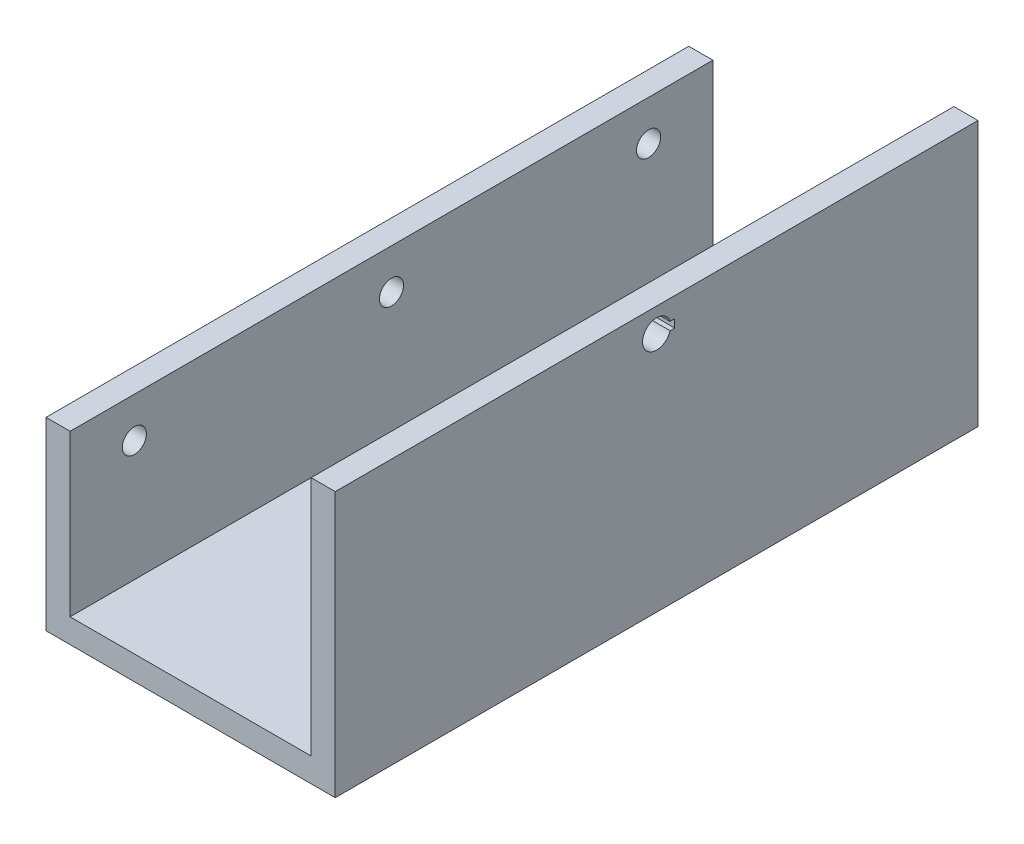
ISO-10303-21;
HEADER;
FILE_DESCRIPTION(('STEP AP214'),'2;1');
FILE_NAME('part.step','',(''),(''),'','','');
FILE_SCHEMA(('AUTOMOTIVE_DESIGN { 1 0 10303 214 1 1 1 1 }'));
ENDSEC;
DATA;
#1=APPLICATION_CONTEXT('core data for automotive mechanical design processes');
#2=APPLICATION_PROTOCOL_DEFINITION('international standard','automotive_design',2000,#1);
#3=PRODUCT_CONTEXT('',#1,'mechanical');
#4=PRODUCT('Part','Part','',(#3));
#5=PRODUCT_RELATED_PRODUCT_CATEGORY('part','',(#4));
#6=PRODUCT_DEFINITION_FORMATION('','',#4);
#7=PRODUCT_DEFINITION_CONTEXT('part definition',#1,'design');
#8=PRODUCT_DEFINITION('design','',#6,#7);
#9=PRODUCT_DEFINITION_SHAPE('','',#8);
#10=(LENGTH_UNIT() NAMED_UNIT(*) SI_UNIT(.MILLI.,.METRE.));
#11=(NAMED_UNIT(*) PLANE_ANGLE_UNIT() SI_UNIT($,.RADIAN.));
#12=(NAMED_UNIT(*) SI_UNIT($,.STERADIAN.) SOLID_ANGLE_UNIT());
#13=UNCERTAINTY_MEASURE_WITH_UNIT(LENGTH_MEASURE(1.E-05),#10,'distance_accuracy_value','');
#14=(GEOMETRIC_REPRESENTATION_CONTEXT(3) GLOBAL_UNCERTAINTY_ASSIGNED_CONTEXT((#13)) GLOBAL_UNIT_ASSIGNED_CONTEXT((#10,
#11,#12)) REPRESENTATION_CONTEXT('',''));
#15=CARTESIAN_POINT('',(0.,0.,0.));
#16=DIRECTION('',(0.,0.,1.));
#17=DIRECTION('',(1.,0.,0.));
#18=AXIS2_PLACEMENT_3D('',#15,#16,#17);
#19=CARTESIAN_POINT('',(0.,0.,0.));
#20=DIRECTION('',(0.,0.,1.));
#21=DIRECTION('',(1.,0.,0.));
#22=AXIS2_PLACEMENT_3D('',#19,#20,#21);
#23=PLANE('',#22);
#24=DIRECTION('',(0.,-1.,0.));
#25=VECTOR('',#24,1.);
#26=CARTESIAN_POINT('',(-33.,2.99999999999999,0.));
#27=LINE('',#26,#25);
#28=CARTESIAN_POINT('',(-33.,-7.00000000000001,0.));
#29=VERTEX_POINT('',#28);
#30=CARTESIAN_POINT('',(-33.,-30.,0.));
#31=VERTEX_POINT('',#30);
#32=EDGE_CURVE('E147',#29,#31,#27,.T.);
#33=ORIENTED_EDGE('',*,*,#32,.F.);
#34=DIRECTION('',(-1.,0.,0.));
#35=VECTOR('',#34,1.);
#36=CARTESIAN_POINT('',(3.00100000000002,-7.,0.));
#37=LINE('',#36,#35);
#38=CARTESIAN_POINT('',(-30.,-7.00000000000001,0.));
#39=VERTEX_POINT('',#38);
#40=EDGE_CURVE('E59',#39,#29,#37,.T.);
#41=ORIENTED_EDGE('',*,*,#40,.F.);
#42=DIRECTION('',(0.,-1.,0.));
#43=VECTOR('',#42,1.);
#44=CARTESIAN_POINT('',(-30.,2.99999999999999,0.));
#45=LINE('',#44,#43);
#46=CARTESIAN_POINT('',(-30.,-27.,0.));
#47=VERTEX_POINT('',#46);
#48=EDGE_CURVE('E144',#39,#47,#45,.T.);
#49=ORIENTED_EDGE('',*,*,#48,.T.);
#50=DIRECTION('',(-1.,0.,0.));
#51=VECTOR('',#50,1.);
#52=CARTESIAN_POINT('',(0.,-27.,0.));
#53=LINE('',#52,#51);
#54=CARTESIAN_POINT('',(0.,-27.,0.));
#55=VERTEX_POINT('',#54);
#56=EDGE_CURVE('E183',#55,#47,#53,.T.);
#57=ORIENTED_EDGE('',*,*,#56,.F.);
#58=DIRECTION('',(0.,-1.,0.));
#59=VECTOR('',#58,1.);
#60=CARTESIAN_POINT('',(0.,3.,0.));
#61=LINE('',#60,#59);
#62=CARTESIAN_POINT('',(0.,3.,0.));
#63=VERTEX_POINT('',#62);
#64=EDGE_CURVE('E178',#63,#55,#61,.T.);
#65=ORIENTED_EDGE('',*,*,#64,.F.);
#66=DIRECTION('',(1.,0.,0.));
#67=VECTOR('',#66,1.);
#68=CARTESIAN_POINT('',(0.,3.,0.));
#69=LINE('',#68,#67);
#70=CARTESIAN_POINT('',(3.,3.,0.));
#71=VERTEX_POINT('',#70);
#72=EDGE_CURVE('E170',#63,#71,#69,.T.);
#73=ORIENTED_EDGE('',*,*,#72,.T.);
#74=DIRECTION('',(0.,-1.,0.));
#75=VECTOR('',#74,1.);
#76=CARTESIAN_POINT('',(3.,3.,0.));
#77=LINE('',#76,#75);
#78=CARTESIAN_POINT('',(3.00000000000001,-30.,0.));
#79=VERTEX_POINT('',#78);
#80=EDGE_CURVE('E187',#71,#79,#77,.T.);
#81=ORIENTED_EDGE('',*,*,#80,.T.);
#82=DIRECTION('',(1.,0.,0.));
#83=VECTOR('',#82,1.);
#84=CARTESIAN_POINT('',(-30.,-30.,0.));
#85=LINE('',#84,#83);
#86=EDGE_CURVE('E207',#31,#79,#85,.T.);
#87=ORIENTED_EDGE('',*,*,#86,.F.);
#88=EDGE_LOOP('',(#33,#41,#49,#57,#65,#73,#81,#87));
#89=FACE_BOUND('',#88,.T.);
#90=ADVANCED_FACE('F42',(#89),#23,.F.);
#91=CARTESIAN_POINT('',(-30.,-30.,2.));
#92=DIRECTION('',(0.,1.,0.));
#93=DIRECTION('',(-1.,0.,0.));
#94=AXIS2_PLACEMENT_3D('',#91,#92,#93);
#95=PLANE('',#94);
#96=CARTESIAN_POINT('',(-15.,-30.,19.53));
#97=DIRECTION('',(0.,-1.,0.));
#98=DIRECTION('',(1.,0.,0.));
#99=AXIS2_PLACEMENT_3D('',#96,#97,#98);
#100=CIRCLE('',#99,4.);
#101=CARTESIAN_POINT('',(-11.,-30.,19.53));
#102=VERTEX_POINT('',#101);
#103=EDGE_CURVE('E194',#102,#102,#100,.T.);
#104=ORIENTED_EDGE('',*,*,#103,.F.);
#105=EDGE_LOOP('',(#104));
#106=FACE_BOUND('',#105,.T.);
#107=ORIENTED_EDGE('',*,*,#86,.T.);
#108=DIRECTION('',(0.,0.,1.));
#109=VECTOR('',#108,1.);
#110=CARTESIAN_POINT('',(3.,-30.,80.));
#111=LINE('',#110,#109);
#112=CARTESIAN_POINT('',(3.,-30.,80.));
#113=VERTEX_POINT('',#112);
#114=EDGE_CURVE('E154',#79,#113,#111,.T.);
#115=ORIENTED_EDGE('',*,*,#114,.T.);
#116=DIRECTION('',(1.,0.,0.));
#117=VECTOR('',#116,1.);
#118=CARTESIAN_POINT('',(-30.,-30.,80.));
#119=LINE('',#118,#117);
#120=CARTESIAN_POINT('',(-33.,-30.,80.));
#121=VERTEX_POINT('',#120);
#122=EDGE_CURVE('E199',#121,#113,#119,.T.);
#123=ORIENTED_EDGE('',*,*,#122,.F.);
#124=DIRECTION('',(0.,0.,-1.));
#125=VECTOR('',#124,1.);
#126=CARTESIAN_POINT('',(-33.,-30.,80.));
#127=LINE('',#126,#125);
#128=EDGE_CURVE('E162',#121,#31,#127,.T.);
#129=ORIENTED_EDGE('',*,*,#128,.T.);
#130=EDGE_LOOP('',(#107,#115,#123,#129));
#131=FACE_BOUND('',#130,.T.);
#132=ADVANCED_FACE('F44',(#106,#131),#95,.F.);
#133=CARTESIAN_POINT('',(-30.,-27.,78.));
#134=DIRECTION('',(0.,-1.,0.));
#135=DIRECTION('',(0.,0.,-1.));
#136=AXIS2_PLACEMENT_3D('',#133,#134,#135);
#137=PLANE('',#136);
#138=CARTESIAN_POINT('',(-15.,-27.,19.53));
#139=DIRECTION('',(0.,-1.,0.));
#140=DIRECTION('',(1.,0.,0.));
#141=AXIS2_PLACEMENT_3D('',#138,#139,#140);
#142=CIRCLE('',#141,4.);
#143=CARTESIAN_POINT('',(-11.,-27.,19.53));
#144=VERTEX_POINT('',#143);
#145=EDGE_CURVE('E196',#144,#144,#142,.T.);
#146=ORIENTED_EDGE('',*,*,#145,.T.);
#147=EDGE_LOOP('',(#146));
#148=FACE_BOUND('',#147,.T.);
#149=DIRECTION('',(0.,0.,-1.));
#150=VECTOR('',#149,1.);
#151=CARTESIAN_POINT('',(0.,-27.,78.));
#152=LINE('',#151,#150);
#153=CARTESIAN_POINT('',(0.,-27.,80.));
#154=VERTEX_POINT('',#153);
#155=EDGE_CURVE('E204',#154,#55,#152,.T.);
#156=ORIENTED_EDGE('',*,*,#155,.T.);
#157=ORIENTED_EDGE('',*,*,#56,.T.);
#158=DIRECTION('',(0.,0.,-1.));
#159=VECTOR('',#158,1.);
#160=CARTESIAN_POINT('',(-30.,-27.,78.));
#161=LINE('',#160,#159);
#162=CARTESIAN_POINT('',(-30.,-27.,80.));
#163=VERTEX_POINT('',#162);
#164=EDGE_CURVE('E153',#163,#47,#161,.T.);
#165=ORIENTED_EDGE('',*,*,#164,.F.);
#166=DIRECTION('',(1.,0.,0.));
#167=VECTOR('',#166,1.);
#168=CARTESIAN_POINT('',(-30.,-27.,80.));
#169=LINE('',#168,#167);
#170=EDGE_CURVE('E191',#163,#154,#169,.T.);
#171=ORIENTED_EDGE('',*,*,#170,.T.);
#172=EDGE_LOOP('',(#156,#157,#165,#171));
#173=FACE_BOUND('',#172,.T.);
#174=ADVANCED_FACE('F265',(#148,#173),#137,.F.);
#175=CARTESIAN_POINT('',(0.,0.,80.));
#176=DIRECTION('',(0.,0.,-1.));
#177=DIRECTION('',(1.,0.,0.));
#178=AXIS2_PLACEMENT_3D('',#175,#176,#177);
#179=PLANE('',#178);
#180=DIRECTION('',(0.,-1.,0.));
#181=VECTOR('',#180,1.);
#182=CARTESIAN_POINT('',(-30.,2.99999999999999,80.));
#183=LINE('',#182,#181);
#184=CARTESIAN_POINT('',(-30.,-7.00000000000001,80.));
#185=VERTEX_POINT('',#184);
#186=EDGE_CURVE('E166',#185,#163,#183,.T.);
#187=ORIENTED_EDGE('',*,*,#186,.F.);
#188=DIRECTION('',(-1.,0.,0.));
#189=VECTOR('',#188,1.);
#190=CARTESIAN_POINT('',(3.00100000000002,-7.,80.));
#191=LINE('',#190,#189);
#192=CARTESIAN_POINT('',(-33.,-7.00000000000001,80.));
#193=VERTEX_POINT('',#192);
#194=EDGE_CURVE('E135',#185,#193,#191,.T.);
#195=ORIENTED_EDGE('',*,*,#194,.T.);
#196=DIRECTION('',(0.,-1.,0.));
#197=VECTOR('',#196,1.);
#198=CARTESIAN_POINT('',(-33.,2.99999999999999,80.));
#199=LINE('',#198,#197);
#200=EDGE_CURVE('E159',#193,#121,#199,.T.);
#201=ORIENTED_EDGE('',*,*,#200,.T.);
#202=ORIENTED_EDGE('',*,*,#122,.T.);
#203=DIRECTION('',(0.,-1.,0.));
#204=VECTOR('',#203,1.);
#205=CARTESIAN_POINT('',(2.99999999999999,3.,80.));
#206=LINE('',#205,#204);
#207=CARTESIAN_POINT('',(2.99999999999999,3.,80.));
#208=VERTEX_POINT('',#207);
#209=EDGE_CURVE('E184',#208,#113,#206,.T.);
#210=ORIENTED_EDGE('',*,*,#209,.F.);
#211=DIRECTION('',(-1.,0.,0.));
#212=VECTOR('',#211,1.);
#213=CARTESIAN_POINT('',(0.,3.,80.));
#214=LINE('',#213,#212);
#215=CARTESIAN_POINT('',(0.,3.,80.));
#216=VERTEX_POINT('',#215);
#217=EDGE_CURVE('E176',#208,#216,#214,.T.);
#218=ORIENTED_EDGE('',*,*,#217,.T.);
#219=DIRECTION('',(0.,-1.,0.));
#220=VECTOR('',#219,1.);
#221=CARTESIAN_POINT('',(0.,3.,80.));
#222=LINE('',#221,#220);
#223=EDGE_CURVE('E180',#216,#154,#222,.T.);
#224=ORIENTED_EDGE('',*,*,#223,.T.);
#225=ORIENTED_EDGE('',*,*,#170,.F.);
#226=EDGE_LOOP('',(#187,#195,#201,#202,#210,#218,#224,#225));
#227=FACE_BOUND('',#226,.T.);
#228=ADVANCED_FACE('F262',(#227),#179,.F.);
#229=CARTESIAN_POINT('',(-15.,-27.,19.53));
#230=DIRECTION('',(0.,-1.,0.));
#231=DIRECTION('',(1.,0.,0.));
#232=AXIS2_PLACEMENT_3D('',#229,#230,#231);
#233=CYLINDRICAL_SURFACE('',#232,4.);
#234=ORIENTED_EDGE('',*,*,#145,.F.);
#235=EDGE_LOOP('',(#234));
#236=FACE_BOUND('',#235,.T.);
#237=ORIENTED_EDGE('',*,*,#103,.T.);
#238=EDGE_LOOP('',(#237));
#239=FACE_BOUND('',#238,.T.);
#240=ADVANCED_FACE('F272',(#236,#239),#233,.F.);
#241=CARTESIAN_POINT('',(0.,3.,80.));
#242=DIRECTION('',(-1.,0.,0.));
#243=DIRECTION('',(0.,-1.,0.));
#244=AXIS2_PLACEMENT_3D('',#241,#242,#243);
#245=PLANE('',#244);
#246=DIRECTION('',(0.,0.,1.));
#247=VECTOR('',#246,1.);
#248=CARTESIAN_POINT('',(0.,-0.5,80.));
#249=LINE('',#248,#247);
#250=CARTESIAN_POINT('',(0.,-0.5,37.75));
#251=VERTEX_POINT('',#250);
#252=CARTESIAN_POINT('',(0.,-0.5,38.3229490168752));
#253=VERTEX_POINT('',#252);
#254=EDGE_CURVE('E236',#251,#253,#249,.T.);
#255=ORIENTED_EDGE('',*,*,#254,.F.);
#256=DIRECTION('',(0.,-1.,0.));
#257=VECTOR('',#256,1.);
#258=CARTESIAN_POINT('',(0.,3.,37.75));
#259=LINE('',#258,#257);
#260=CARTESIAN_POINT('',(0.,0.500000000000001,37.75));
#261=VERTEX_POINT('',#260);
#262=EDGE_CURVE('E240',#261,#251,#259,.T.);
#263=ORIENTED_EDGE('',*,*,#262,.F.);
#264=DIRECTION('',(0.,0.,-1.));
#265=VECTOR('',#264,1.);
#266=CARTESIAN_POINT('',(0.,0.500000000000001,80.));
#267=LINE('',#266,#265);
#268=CARTESIAN_POINT('',(0.,0.500000000000001,38.3229490168752));
#269=VERTEX_POINT('',#268);
#270=EDGE_CURVE('E232',#269,#261,#267,.T.);
#271=ORIENTED_EDGE('',*,*,#270,.F.);
#272=CARTESIAN_POINT('',(0.,0.,40.));
#273=DIRECTION('',(-1.,0.,0.));
#274=DIRECTION('',(0.,-1.,0.));
#275=AXIS2_PLACEMENT_3D('',#272,#273,#274);
#276=CIRCLE('',#275,1.75);
#277=EDGE_CURVE('E244',#253,#269,#276,.T.);
#278=ORIENTED_EDGE('',*,*,#277,.F.);
#279=EDGE_LOOP('',(#255,#263,#271,#278));
#280=FACE_BOUND('',#279,.T.);
#281=ORIENTED_EDGE('',*,*,#155,.F.);
#282=ORIENTED_EDGE('',*,*,#223,.F.);
#283=DIRECTION('',(0.,0.,-1.));
#284=VECTOR('',#283,1.);
#285=CARTESIAN_POINT('',(0.,3.,80.));
#286=LINE('',#285,#284);
#287=EDGE_CURVE('E157',#216,#63,#286,.T.);
#288=ORIENTED_EDGE('',*,*,#287,.T.);
#289=ORIENTED_EDGE('',*,*,#64,.T.);
#290=EDGE_LOOP('',(#281,#282,#288,#289));
#291=FACE_BOUND('',#290,.T.);
#292=ADVANCED_FACE('F270',(#280,#291),#245,.T.);
#293=CARTESIAN_POINT('',(2.99999999999999,3.,80.));
#294=DIRECTION('',(1.,0.,0.));
#295=DIRECTION('',(0.,1.,0.));
#296=AXIS2_PLACEMENT_3D('',#293,#294,#295);
#297=PLANE('',#296);
#298=DIRECTION('',(0.,0.,-1.));
#299=VECTOR('',#298,1.);
#300=CARTESIAN_POINT('',(2.99999999999999,-0.499999999999999,80.));
#301=LINE('',#300,#299);
#302=CARTESIAN_POINT('',(3.00000000000002,-0.499999999999999,38.3229490168752));
#303=VERTEX_POINT('',#302);
#304=CARTESIAN_POINT('',(3.,-0.499999999999999,37.75));
#305=VERTEX_POINT('',#304);
#306=EDGE_CURVE('E234',#303,#305,#301,.T.);
#307=ORIENTED_EDGE('',*,*,#306,.F.);
#308=CARTESIAN_POINT('',(3.00000000000002,0.,40.));
#309=DIRECTION('',(-1.,0.,0.));
#310=DIRECTION('',(0.,-1.,0.));
#311=AXIS2_PLACEMENT_3D('',#308,#309,#310);
#312=CIRCLE('',#311,1.75);
#313=CARTESIAN_POINT('',(3.00000000000002,0.500000000000002,38.3229490168752));
#314=VERTEX_POINT('',#313);
#315=EDGE_CURVE('E242',#303,#314,#312,.T.);
#316=ORIENTED_EDGE('',*,*,#315,.T.);
#317=DIRECTION('',(0.,0.,1.));
#318=VECTOR('',#317,1.);
#319=CARTESIAN_POINT('',(2.99999999999999,0.500000000000002,80.));
#320=LINE('',#319,#318);
#321=CARTESIAN_POINT('',(3.,0.500000000000002,37.75));
#322=VERTEX_POINT('',#321);
#323=EDGE_CURVE('E67',#322,#314,#320,.T.);
#324=ORIENTED_EDGE('',*,*,#323,.F.);
#325=DIRECTION('',(0.,1.,0.));
#326=VECTOR('',#325,1.);
#327=CARTESIAN_POINT('',(3.,3.,37.75));
#328=LINE('',#327,#326);
#329=EDGE_CURVE('E238',#305,#322,#328,.T.);
#330=ORIENTED_EDGE('',*,*,#329,.F.);
#331=EDGE_LOOP('',(#307,#316,#324,#330));
#332=FACE_BOUND('',#331,.T.);
#333=ORIENTED_EDGE('',*,*,#114,.F.);
#334=ORIENTED_EDGE('',*,*,#80,.F.);
#335=DIRECTION('',(0.,0.,1.));
#336=VECTOR('',#335,1.);
#337=CARTESIAN_POINT('',(2.99999999999999,3.,80.));
#338=LINE('',#337,#336);
#339=EDGE_CURVE('E173',#71,#208,#338,.T.);
#340=ORIENTED_EDGE('',*,*,#339,.T.);
#341=ORIENTED_EDGE('',*,*,#209,.T.);
#342=EDGE_LOOP('',(#333,#334,#340,#341));
#343=FACE_BOUND('',#342,.T.);
#344=ADVANCED_FACE('F259',(#332,#343),#297,.T.);
#345=CARTESIAN_POINT('',(0.,3.,0.));
#346=DIRECTION('',(0.,-1.,0.));
#347=DIRECTION('',(0.,0.,-1.));
#348=AXIS2_PLACEMENT_3D('',#345,#346,#347);
#349=PLANE('',#348);
#350=ORIENTED_EDGE('',*,*,#287,.F.);
#351=ORIENTED_EDGE('',*,*,#217,.F.);
#352=ORIENTED_EDGE('',*,*,#339,.F.);
#353=ORIENTED_EDGE('',*,*,#72,.F.);
#354=EDGE_LOOP('',(#350,#351,#352,#353));
#355=FACE_BOUND('',#354,.T.);
#356=ADVANCED_FACE('F269',(#355),#349,.F.);
#357=CARTESIAN_POINT('',(-30.,2.99999999999999,80.));
#358=DIRECTION('',(1.,0.,0.));
#359=DIRECTION('',(0.,1.,0.));
#360=AXIS2_PLACEMENT_3D('',#357,#358,#359);
#361=PLANE('',#360);
#362=CARTESIAN_POINT('',(-29.9999999999999,-12.,8.00000000000002));
#363=DIRECTION('',(-1.,0.,0.));
#364=DIRECTION('',(0.,0.,1.));
#365=AXIS2_PLACEMENT_3D('',#362,#363,#364);
#366=CIRCLE('',#365,1.5);
#367=CARTESIAN_POINT('',(-29.9999999999999,-12.,9.50000000000003));
#368=VERTEX_POINT('',#367);
#369=EDGE_CURVE('E213',#368,#368,#366,.T.);
#370=ORIENTED_EDGE('',*,*,#369,.T.);
#371=EDGE_LOOP('',(#370));
#372=FACE_BOUND('',#371,.T.);
#373=CARTESIAN_POINT('',(-29.9999999999998,-12.,40.));
#374=DIRECTION('',(-1.,0.,0.));
#375=DIRECTION('',(0.,0.,1.));
#376=AXIS2_PLACEMENT_3D('',#373,#374,#375);
#377=CIRCLE('',#376,1.5);
#378=CARTESIAN_POINT('',(-29.9999999999998,-12.,41.5));
#379=VERTEX_POINT('',#378);
#380=EDGE_CURVE('E468',#379,#379,#377,.T.);
#381=ORIENTED_EDGE('',*,*,#380,.T.);
#382=EDGE_LOOP('',(#381));
#383=FACE_BOUND('',#382,.T.);
#384=CARTESIAN_POINT('',(-29.9999999999997,-12.,72.));
#385=DIRECTION('',(-1.,0.,0.));
#386=DIRECTION('',(0.,0.,1.));
#387=AXIS2_PLACEMENT_3D('',#384,#385,#386);
#388=CIRCLE('',#387,1.5);
#389=CARTESIAN_POINT('',(-29.9999999999997,-12.,73.5));
#390=VERTEX_POINT('',#389);
#391=EDGE_CURVE('E223',#390,#390,#388,.T.);
#392=ORIENTED_EDGE('',*,*,#391,.T.);
#393=EDGE_LOOP('',(#392));
#394=FACE_BOUND('',#393,.T.);
#395=DIRECTION('',(0.,0.,1.));
#396=VECTOR('',#395,1.);
#397=CARTESIAN_POINT('',(-30.,-7.00000000000001,0.));
#398=LINE('',#397,#396);
#399=EDGE_CURVE('E132',#39,#185,#398,.T.);
#400=ORIENTED_EDGE('',*,*,#399,.T.);
#401=ORIENTED_EDGE('',*,*,#186,.T.);
#402=ORIENTED_EDGE('',*,*,#164,.T.);
#403=ORIENTED_EDGE('',*,*,#48,.F.);
#404=EDGE_LOOP('',(#400,#401,#402,#403));
#405=FACE_BOUND('',#404,.T.);
#406=ADVANCED_FACE('F151',(#372,#383,#394,#405),#361,.T.);
#407=CARTESIAN_POINT('',(-33.,2.99999999999999,80.));
#408=DIRECTION('',(-1.,0.,0.));
#409=DIRECTION('',(0.,-1.,0.));
#410=AXIS2_PLACEMENT_3D('',#407,#408,#409);
#411=PLANE('',#410);
#412=CARTESIAN_POINT('',(-33.,-12.,8.00000000000004));
#413=DIRECTION('',(-1.,0.,0.));
#414=DIRECTION('',(0.,-1.,0.));
#415=AXIS2_PLACEMENT_3D('',#412,#413,#414);
#416=CIRCLE('',#415,1.5);
#417=CARTESIAN_POINT('',(-33.,-13.5,8.00000000000004));
#418=VERTEX_POINT('',#417);
#419=EDGE_CURVE('E46',#418,#418,#416,.T.);
#420=ORIENTED_EDGE('',*,*,#419,.F.);
#421=EDGE_LOOP('',(#420));
#422=FACE_BOUND('',#421,.T.);
#423=CARTESIAN_POINT('',(-33.,-12.,40.));
#424=DIRECTION('',(-1.,0.,0.));
#425=DIRECTION('',(0.,-1.,0.));
#426=AXIS2_PLACEMENT_3D('',#423,#424,#425);
#427=CIRCLE('',#426,1.5);
#428=CARTESIAN_POINT('',(-33.,-13.5,40.));
#429=VERTEX_POINT('',#428);
#430=EDGE_CURVE('E212',#429,#429,#427,.T.);
#431=ORIENTED_EDGE('',*,*,#430,.F.);
#432=EDGE_LOOP('',(#431));
#433=FACE_BOUND('',#432,.T.);
#434=CARTESIAN_POINT('',(-33.,-12.,72.));
#435=DIRECTION('',(-1.,0.,0.));
#436=DIRECTION('',(0.,-1.,0.));
#437=AXIS2_PLACEMENT_3D('',#434,#435,#436);
#438=CIRCLE('',#437,1.5);
#439=CARTESIAN_POINT('',(-33.,-13.5,72.));
#440=VERTEX_POINT('',#439);
#441=EDGE_CURVE('E210',#440,#440,#438,.T.);
#442=ORIENTED_EDGE('',*,*,#441,.F.);
#443=EDGE_LOOP('',(#442));
#444=FACE_BOUND('',#443,.T.);
#445=DIRECTION('',(0.,0.,1.));
#446=VECTOR('',#445,1.);
#447=CARTESIAN_POINT('',(-33.,-7.00000000000001,0.));
#448=LINE('',#447,#446);
#449=EDGE_CURVE('E148',#29,#193,#448,.T.);
#450=ORIENTED_EDGE('',*,*,#449,.F.);
#451=ORIENTED_EDGE('',*,*,#32,.T.);
#452=ORIENTED_EDGE('',*,*,#128,.F.);
#453=ORIENTED_EDGE('',*,*,#200,.F.);
#454=EDGE_LOOP('',(#450,#451,#452,#453));
#455=FACE_BOUND('',#454,.T.);
#456=ADVANCED_FACE('F254',(#422,#433,#444,#455),#411,.T.);
#457=CARTESIAN_POINT('',(3.00000000000002,0.,40.));
#458=DIRECTION('',(-1.,0.,0.));
#459=DIRECTION('',(0.,-1.,0.));
#460=AXIS2_PLACEMENT_3D('',#457,#458,#459);
#461=CYLINDRICAL_SURFACE('',#460,1.75);
#462=ORIENTED_EDGE('',*,*,#315,.F.);
#463=DIRECTION('',(-1.,0.,0.));
#464=VECTOR('',#463,1.);
#465=CARTESIAN_POINT('',(3.00000000000002,-0.499999999999999,38.3229490168752));
#466=LINE('',#465,#464);
#467=EDGE_CURVE('E12',#303,#253,#466,.T.);
#468=ORIENTED_EDGE('',*,*,#467,.T.);
#469=ORIENTED_EDGE('',*,*,#277,.T.);
#470=DIRECTION('',(-1.,0.,0.));
#471=VECTOR('',#470,1.);
#472=CARTESIAN_POINT('',(3.00000000000002,0.500000000000002,38.3229490168752));
#473=LINE('',#472,#471);
#474=EDGE_CURVE('E51',#269,#314,#473,.F.);
#475=ORIENTED_EDGE('',*,*,#474,.T.);
#476=EDGE_LOOP('',(#462,#468,#469,#475));
#477=FACE_BOUND('',#476,.T.);
#478=ADVANCED_FACE('F326',(#477),#461,.F.);
#479=CARTESIAN_POINT('',(17.,-0.499999999999996,38.3229490168752));
#480=DIRECTION('',(0.,-1.,0.));
#481=DIRECTION('',(1.,0.,0.));
#482=AXIS2_PLACEMENT_3D('',#479,#480,#481);
#483=PLANE('',#482);
#484=ORIENTED_EDGE('',*,*,#254,.T.);
#485=ORIENTED_EDGE('',*,*,#467,.F.);
#486=ORIENTED_EDGE('',*,*,#306,.T.);
#487=DIRECTION('',(-1.,0.,0.));
#488=VECTOR('',#487,1.);
#489=CARTESIAN_POINT('',(17.,-0.499999999999996,37.75));
#490=LINE('',#489,#488);
#491=EDGE_CURVE('E226',#305,#251,#490,.T.);
#492=ORIENTED_EDGE('',*,*,#491,.T.);
#493=EDGE_LOOP('',(#484,#485,#486,#492));
#494=FACE_BOUND('',#493,.T.);
#495=ADVANCED_FACE('F358',(#494),#483,.F.);
#496=CARTESIAN_POINT('',(17.,0.500000000000005,37.75));
#497=DIRECTION('',(0.,1.,0.));
#498=DIRECTION('',(-1.,0.,0.));
#499=AXIS2_PLACEMENT_3D('',#496,#497,#498);
#500=PLANE('',#499);
#501=ORIENTED_EDGE('',*,*,#270,.T.);
#502=DIRECTION('',(-1.,0.,0.));
#503=VECTOR('',#502,1.);
#504=CARTESIAN_POINT('',(17.,0.500000000000005,37.75));
#505=LINE('',#504,#503);
#506=EDGE_CURVE('E139',#322,#261,#505,.T.);
#507=ORIENTED_EDGE('',*,*,#506,.F.);
#508=ORIENTED_EDGE('',*,*,#323,.T.);
#509=ORIENTED_EDGE('',*,*,#474,.F.);
#510=EDGE_LOOP('',(#501,#507,#508,#509));
#511=FACE_BOUND('',#510,.T.);
#512=ADVANCED_FACE('F361',(#511),#500,.F.);
#513=CARTESIAN_POINT('',(17.,-0.499999999999996,37.75));
#514=DIRECTION('',(0.,0.,-1.));
#515=DIRECTION('',(-1.,0.,0.));
#516=AXIS2_PLACEMENT_3D('',#513,#514,#515);
#517=PLANE('',#516);
#518=ORIENTED_EDGE('',*,*,#262,.T.);
#519=ORIENTED_EDGE('',*,*,#491,.F.);
#520=ORIENTED_EDGE('',*,*,#329,.T.);
#521=ORIENTED_EDGE('',*,*,#506,.T.);
#522=EDGE_LOOP('',(#518,#519,#520,#521));
#523=FACE_BOUND('',#522,.T.);
#524=ADVANCED_FACE('F306',(#523),#517,.F.);
#525=CARTESIAN_POINT('',(3.00100000000002,-7.,0.));
#526=DIRECTION('',(0.,-1.,0.));
#527=DIRECTION('',(1.,0.,0.));
#528=AXIS2_PLACEMENT_3D('',#525,#526,#527);
#529=PLANE('',#528);
#530=ORIENTED_EDGE('',*,*,#40,.T.);
#531=ORIENTED_EDGE('',*,*,#449,.T.);
#532=ORIENTED_EDGE('',*,*,#194,.F.);
#533=ORIENTED_EDGE('',*,*,#399,.F.);
#534=EDGE_LOOP('',(#530,#531,#532,#533));
#535=FACE_BOUND('',#534,.T.);
#536=ADVANCED_FACE('F133',(#535),#529,.F.);
#537=CARTESIAN_POINT('',(-29.9999999999997,-12.,72.));
#538=DIRECTION('',(-1.,0.,0.));
#539=DIRECTION('',(0.,0.,1.));
#540=AXIS2_PLACEMENT_3D('',#537,#538,#539);
#541=CYLINDRICAL_SURFACE('',#540,1.5);
#542=ORIENTED_EDGE('',*,*,#441,.T.);
#543=EDGE_LOOP('',(#542));
#544=FACE_BOUND('',#543,.T.);
#545=ORIENTED_EDGE('',*,*,#391,.F.);
#546=EDGE_LOOP('',(#545));
#547=FACE_BOUND('',#546,.T.);
#548=ADVANCED_FACE('F305',(#544,#547),#541,.F.);
#549=CARTESIAN_POINT('',(-29.9999999999998,-12.,40.));
#550=DIRECTION('',(-1.,0.,0.));
#551=DIRECTION('',(0.,0.,1.));
#552=AXIS2_PLACEMENT_3D('',#549,#550,#551);
#553=CYLINDRICAL_SURFACE('',#552,1.5);
#554=ORIENTED_EDGE('',*,*,#430,.T.);
#555=EDGE_LOOP('',(#554));
#556=FACE_BOUND('',#555,.T.);
#557=ORIENTED_EDGE('',*,*,#380,.F.);
#558=EDGE_LOOP('',(#557));
#559=FACE_BOUND('',#558,.T.);
#560=ADVANCED_FACE('F334',(#556,#559),#553,.F.);
#561=CARTESIAN_POINT('',(-29.9999999999999,-12.,8.00000000000002));
#562=DIRECTION('',(-1.,0.,0.));
#563=DIRECTION('',(0.,0.,1.));
#564=AXIS2_PLACEMENT_3D('',#561,#562,#563);
#565=CYLINDRICAL_SURFACE('',#564,1.5);
#566=ORIENTED_EDGE('',*,*,#419,.T.);
#567=EDGE_LOOP('',(#566));
#568=FACE_BOUND('',#567,.T.);
#569=ORIENTED_EDGE('',*,*,#369,.F.);
#570=EDGE_LOOP('',(#569));
#571=FACE_BOUND('',#570,.T.);
#572=ADVANCED_FACE('F344',(#568,#571),#565,.F.);
#573=CLOSED_SHELL('',(#90,#132,#174,#228,#240,#292,#344,#356,#406,#456,#478,#495,#512,#524,#536,
#548,#560,#572));
#574=MANIFOLD_SOLID_BREP('B2',#573);
#575=ADVANCED_BREP_SHAPE_REPRESENTATION('',(#18,#574),#14);
#576=SHAPE_DEFINITION_REPRESENTATION(#9,#575);
ENDSEC;
END-ISO-10303-21;
